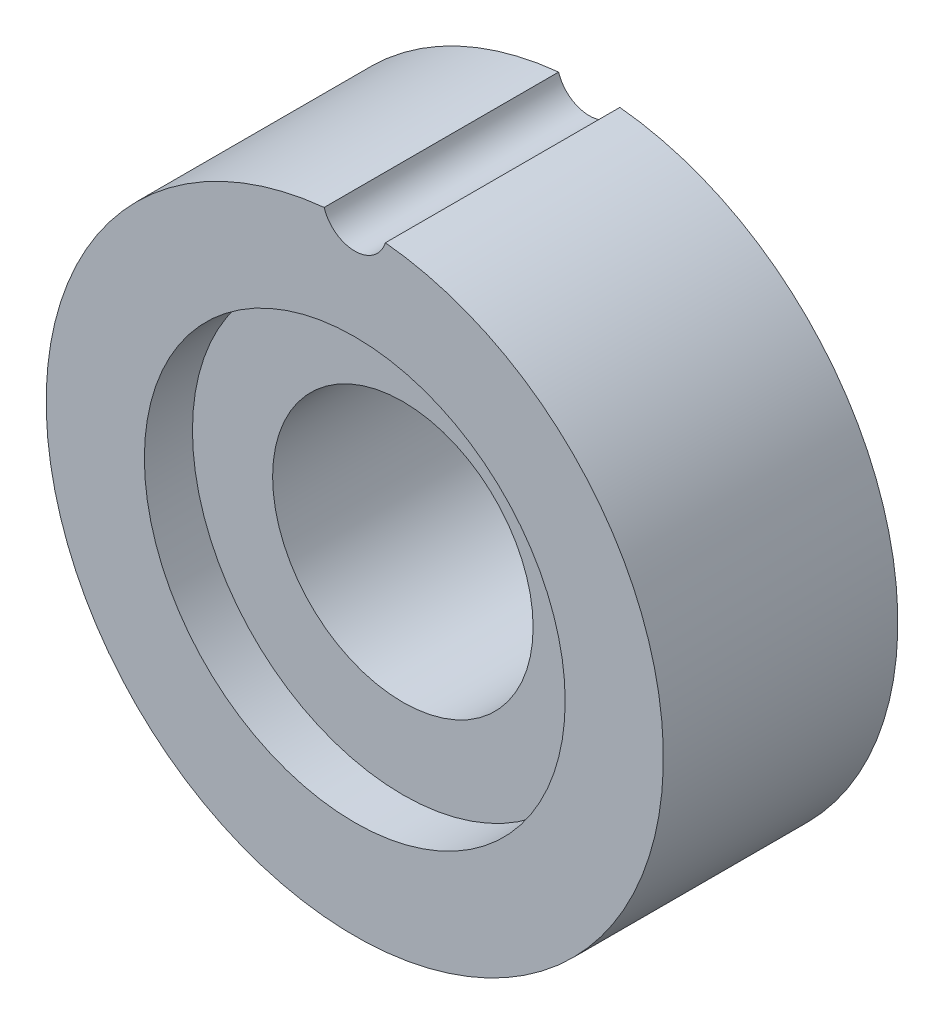
ISO-10303-21;
HEADER;
FILE_DESCRIPTION(('STEP AP214'),'2;1');
FILE_NAME('part.step','',(''),(''),'','','');
FILE_SCHEMA(('AUTOMOTIVE_DESIGN { 1 0 10303 214 1 1 1 1 }'));
ENDSEC;
DATA;
#1=APPLICATION_CONTEXT('core data for automotive mechanical design processes');
#2=APPLICATION_PROTOCOL_DEFINITION('international standard','automotive_design',2000,#1);
#3=PRODUCT_CONTEXT('',#1,'mechanical');
#4=PRODUCT('Part','Part','',(#3));
#5=PRODUCT_RELATED_PRODUCT_CATEGORY('part','',(#4));
#6=PRODUCT_DEFINITION_FORMATION('','',#4);
#7=PRODUCT_DEFINITION_CONTEXT('part definition',#1,'design');
#8=PRODUCT_DEFINITION('design','',#6,#7);
#9=PRODUCT_DEFINITION_SHAPE('','',#8);
#10=(LENGTH_UNIT() NAMED_UNIT(*) SI_UNIT(.MILLI.,.METRE.));
#11=(NAMED_UNIT(*) PLANE_ANGLE_UNIT() SI_UNIT($,.RADIAN.));
#12=(NAMED_UNIT(*) SI_UNIT($,.STERADIAN.) SOLID_ANGLE_UNIT());
#13=UNCERTAINTY_MEASURE_WITH_UNIT(LENGTH_MEASURE(1.E-05),#10,'distance_accuracy_value','');
#14=(GEOMETRIC_REPRESENTATION_CONTEXT(3) GLOBAL_UNCERTAINTY_ASSIGNED_CONTEXT((#13)) GLOBAL_UNIT_ASSIGNED_CONTEXT((#10,
#11,#12)) REPRESENTATION_CONTEXT('',''));
#15=CARTESIAN_POINT('',(0.,0.,0.));
#16=DIRECTION('',(0.,0.,1.));
#17=DIRECTION('',(1.,0.,0.));
#18=AXIS2_PLACEMENT_3D('',#15,#16,#17);
#19=CARTESIAN_POINT('',(0.,0.,5.85));
#20=DIRECTION('',(0.,0.,-1.));
#21=DIRECTION('',(-1.,0.,0.));
#22=AXIS2_PLACEMENT_3D('',#19,#20,#21);
#23=CYLINDRICAL_SURFACE('',#22,3.25);
#24=CARTESIAN_POINT('',(0.,0.,0.));
#25=DIRECTION('',(0.,0.,1.));
#26=DIRECTION('',(1.,0.,0.));
#27=AXIS2_PLACEMENT_3D('',#24,#25,#26);
#28=CIRCLE('',#27,3.25);
#29=CARTESIAN_POINT('',(3.25,0.,0.));
#30=VERTEX_POINT('',#29);
#31=EDGE_CURVE('E71',#30,#30,#28,.T.);
#32=ORIENTED_EDGE('',*,*,#31,.F.);
#33=EDGE_LOOP('',(#32));
#34=FACE_BOUND('',#33,.T.);
#35=CARTESIAN_POINT('',(0.,0.,4.65));
#36=DIRECTION('',(0.,0.,1.));
#37=DIRECTION('',(1.,0.,0.));
#38=AXIS2_PLACEMENT_3D('',#35,#36,#37);
#39=CIRCLE('',#38,3.25);
#40=CARTESIAN_POINT('',(3.25,0.,4.65));
#41=VERTEX_POINT('',#40);
#42=EDGE_CURVE('E75',#41,#41,#39,.T.);
#43=ORIENTED_EDGE('',*,*,#42,.T.);
#44=EDGE_LOOP('',(#43));
#45=FACE_BOUND('',#44,.T.);
#46=ADVANCED_FACE('F35',(#34,#45),#23,.F.);
#47=CARTESIAN_POINT('',(0.,0.,5.85));
#48=DIRECTION('',(0.,0.,1.));
#49=DIRECTION('',(1.,0.,0.));
#50=AXIS2_PLACEMENT_3D('',#47,#48,#49);
#51=PLANE('',#50);
#52=CARTESIAN_POINT('',(0.,7.9,5.85));
#53=DIRECTION('',(0.,0.,1.));
#54=DIRECTION('',(1.,0.,0.));
#55=AXIS2_PLACEMENT_3D('',#52,#53,#54);
#56=CIRCLE('',#55,0.8);
#57=CARTESIAN_POINT('',(-0.763785342875856,7.6620253164557,5.85));
#58=VERTEX_POINT('',#57);
#59=CARTESIAN_POINT('',(0.763785342875857,7.6620253164557,5.85));
#60=VERTEX_POINT('',#59);
#61=EDGE_CURVE('E55',#58,#60,#56,.T.);
#62=ORIENTED_EDGE('',*,*,#61,.F.);
#63=CARTESIAN_POINT('',(0.,0.,5.85));
#64=DIRECTION('',(0.,0.,1.));
#65=DIRECTION('',(1.,0.,0.));
#66=AXIS2_PLACEMENT_3D('',#63,#64,#65);
#67=CIRCLE('',#66,7.7);
#68=EDGE_CURVE('E70',#58,#60,#67,.T.);
#69=ORIENTED_EDGE('',*,*,#68,.T.);
#70=EDGE_LOOP('',(#62,#69));
#71=FACE_BOUND('',#70,.T.);
#72=CARTESIAN_POINT('',(0.,0.,5.85));
#73=DIRECTION('',(0.,0.,1.));
#74=DIRECTION('',(1.,0.,0.));
#75=AXIS2_PLACEMENT_3D('',#72,#73,#74);
#76=CIRCLE('',#75,5.25);
#77=CARTESIAN_POINT('',(5.25,0.,5.85));
#78=VERTEX_POINT('',#77);
#79=EDGE_CURVE('E83',#78,#78,#76,.T.);
#80=ORIENTED_EDGE('',*,*,#79,.F.);
#81=EDGE_LOOP('',(#80));
#82=FACE_BOUND('',#81,.T.);
#83=ADVANCED_FACE('F94',(#71,#82),#51,.T.);
#84=CARTESIAN_POINT('',(0.,0.,0.));
#85=DIRECTION('',(0.,0.,1.));
#86=DIRECTION('',(1.,0.,0.));
#87=AXIS2_PLACEMENT_3D('',#84,#85,#86);
#88=PLANE('',#87);
#89=CARTESIAN_POINT('',(0.,0.,0.));
#90=DIRECTION('',(0.,0.,1.));
#91=DIRECTION('',(1.,0.,0.));
#92=AXIS2_PLACEMENT_3D('',#89,#90,#91);
#93=CIRCLE('',#92,7.7);
#94=CARTESIAN_POINT('',(-0.763785342875856,7.6620253164557,0.));
#95=VERTEX_POINT('',#94);
#96=CARTESIAN_POINT('',(0.763785342875856,7.6620253164557,0.));
#97=VERTEX_POINT('',#96);
#98=EDGE_CURVE('E68',#95,#97,#93,.T.);
#99=ORIENTED_EDGE('',*,*,#98,.F.);
#100=CARTESIAN_POINT('',(0.,7.9,0.));
#101=DIRECTION('',(0.,0.,-1.));
#102=DIRECTION('',(-1.,0.,0.));
#103=AXIS2_PLACEMENT_3D('',#100,#101,#102);
#104=CIRCLE('',#103,0.8);
#105=EDGE_CURVE('E50',#97,#95,#104,.T.);
#106=ORIENTED_EDGE('',*,*,#105,.F.);
#107=EDGE_LOOP('',(#99,#106));
#108=FACE_BOUND('',#107,.T.);
#109=ORIENTED_EDGE('',*,*,#31,.T.);
#110=EDGE_LOOP('',(#109));
#111=FACE_BOUND('',#110,.T.);
#112=ADVANCED_FACE('F66',(#108,#111),#88,.F.);
#113=CARTESIAN_POINT('',(0.,0.,5.85));
#114=DIRECTION('',(0.,0.,-1.));
#115=DIRECTION('',(-1.,0.,0.));
#116=AXIS2_PLACEMENT_3D('',#113,#114,#115);
#117=CYLINDRICAL_SURFACE('',#116,7.7);
#118=ORIENTED_EDGE('',*,*,#98,.T.);
#119=DIRECTION('',(0.,0.,-1.));
#120=VECTOR('',#119,1.);
#121=CARTESIAN_POINT('',(0.763785342875856,7.6620253164557,5.));
#122=LINE('',#121,#120);
#123=EDGE_CURVE('E11',#97,#60,#122,.F.);
#124=ORIENTED_EDGE('',*,*,#123,.T.);
#125=ORIENTED_EDGE('',*,*,#68,.F.);
#126=DIRECTION('',(0.,0.,-1.));
#127=VECTOR('',#126,1.);
#128=CARTESIAN_POINT('',(-0.763785342875856,7.6620253164557,5.));
#129=LINE('',#128,#127);
#130=EDGE_CURVE('E43',#58,#95,#129,.T.);
#131=ORIENTED_EDGE('',*,*,#130,.T.);
#132=EDGE_LOOP('',(#118,#124,#125,#131));
#133=FACE_BOUND('',#132,.T.);
#134=ADVANCED_FACE('F37',(#133),#117,.T.);
#135=CARTESIAN_POINT('',(0.,0.,4.65));
#136=DIRECTION('',(0.,0.,1.));
#137=DIRECTION('',(1.,0.,0.));
#138=AXIS2_PLACEMENT_3D('',#135,#136,#137);
#139=CYLINDRICAL_SURFACE('',#138,5.25);
#140=CARTESIAN_POINT('',(0.,0.,4.65));
#141=DIRECTION('',(0.,0.,1.));
#142=DIRECTION('',(1.,0.,0.));
#143=AXIS2_PLACEMENT_3D('',#140,#141,#142);
#144=CIRCLE('',#143,5.25);
#145=CARTESIAN_POINT('',(5.25,0.,4.65));
#146=VERTEX_POINT('',#145);
#147=EDGE_CURVE('E79',#146,#146,#144,.T.);
#148=ORIENTED_EDGE('',*,*,#147,.F.);
#149=EDGE_LOOP('',(#148));
#150=FACE_BOUND('',#149,.T.);
#151=ORIENTED_EDGE('',*,*,#79,.T.);
#152=EDGE_LOOP('',(#151));
#153=FACE_BOUND('',#152,.T.);
#154=ADVANCED_FACE('F92',(#150,#153),#139,.F.);
#155=CARTESIAN_POINT('',(0.,0.,4.65));
#156=DIRECTION('',(0.,0.,1.));
#157=DIRECTION('',(1.,0.,0.));
#158=AXIS2_PLACEMENT_3D('',#155,#156,#157);
#159=PLANE('',#158);
#160=ORIENTED_EDGE('',*,*,#42,.F.);
#161=EDGE_LOOP('',(#160));
#162=FACE_BOUND('',#161,.T.);
#163=ORIENTED_EDGE('',*,*,#147,.T.);
#164=EDGE_LOOP('',(#163));
#165=FACE_BOUND('',#164,.T.);
#166=ADVANCED_FACE('F108',(#162,#165),#159,.T.);
#167=CARTESIAN_POINT('',(0.,7.9,10.));
#168=DIRECTION('',(0.,0.,-1.));
#169=DIRECTION('',(-1.,0.,0.));
#170=AXIS2_PLACEMENT_3D('',#167,#168,#169);
#171=CYLINDRICAL_SURFACE('',#170,0.8);
#172=ORIENTED_EDGE('',*,*,#105,.T.);
#173=ORIENTED_EDGE('',*,*,#130,.F.);
#174=ORIENTED_EDGE('',*,*,#61,.T.);
#175=ORIENTED_EDGE('',*,*,#123,.F.);
#176=EDGE_LOOP('',(#172,#173,#174,#175));
#177=FACE_BOUND('',#176,.T.);
#178=ADVANCED_FACE('F59',(#177),#171,.F.);
#179=CLOSED_SHELL('',(#46,#83,#112,#134,#154,#166,#178));
#180=MANIFOLD_SOLID_BREP('B2',#179);
#181=ADVANCED_BREP_SHAPE_REPRESENTATION('',(#18,#180),#14);
#182=SHAPE_DEFINITION_REPRESENTATION(#9,#181);
ENDSEC;
END-ISO-10303-21;
